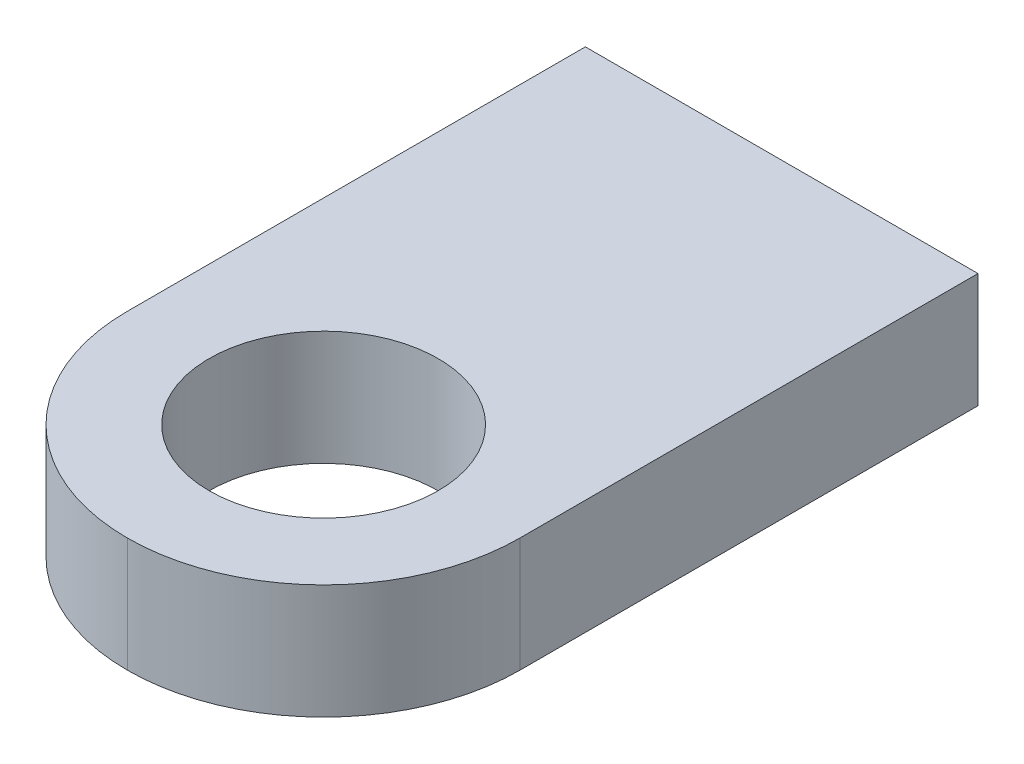
ISO-10303-21;
HEADER;
FILE_DESCRIPTION(('STEP AP214'),'2;1');
FILE_NAME('part.step','',(''),(''),'','','');
FILE_SCHEMA(('AUTOMOTIVE_DESIGN { 1 0 10303 214 1 1 1 1 }'));
ENDSEC;
DATA;
#1=APPLICATION_CONTEXT('core data for automotive mechanical design processes');
#2=APPLICATION_PROTOCOL_DEFINITION('international standard','automotive_design',2000,#1);
#3=PRODUCT_CONTEXT('',#1,'mechanical');
#4=PRODUCT('Part','Part','',(#3));
#5=PRODUCT_RELATED_PRODUCT_CATEGORY('part','',(#4));
#6=PRODUCT_DEFINITION_FORMATION('','',#4);
#7=PRODUCT_DEFINITION_CONTEXT('part definition',#1,'design');
#8=PRODUCT_DEFINITION('design','',#6,#7);
#9=PRODUCT_DEFINITION_SHAPE('','',#8);
#10=(LENGTH_UNIT() NAMED_UNIT(*) SI_UNIT(.MILLI.,.METRE.));
#11=(NAMED_UNIT(*) PLANE_ANGLE_UNIT() SI_UNIT($,.RADIAN.));
#12=(NAMED_UNIT(*) SI_UNIT($,.STERADIAN.) SOLID_ANGLE_UNIT());
#13=UNCERTAINTY_MEASURE_WITH_UNIT(LENGTH_MEASURE(1.E-05),#10,'distance_accuracy_value','');
#14=(GEOMETRIC_REPRESENTATION_CONTEXT(3) GLOBAL_UNCERTAINTY_ASSIGNED_CONTEXT((#13)) GLOBAL_UNIT_ASSIGNED_CONTEXT((#10,
#11,#12)) REPRESENTATION_CONTEXT('',''));
#15=CARTESIAN_POINT('',(0.,0.,0.));
#16=DIRECTION('',(0.,0.,1.));
#17=DIRECTION('',(1.,0.,0.));
#18=AXIS2_PLACEMENT_3D('',#15,#16,#17);
#19=CARTESIAN_POINT('',(15.1,0.,19.));
#20=DIRECTION('',(0.,1.,0.));
#21=DIRECTION('',(-1.,0.,0.));
#22=AXIS2_PLACEMENT_3D('',#19,#20,#21);
#23=CYLINDRICAL_SURFACE('',#22,6.);
#24=DIRECTION('',(0.,-1.,0.));
#25=VECTOR('',#24,1.);
#26=CARTESIAN_POINT('',(9.1,12.,19.));
#27=LINE('',#26,#25);
#28=CARTESIAN_POINT('',(9.1,8.5,19.));
#29=VERTEX_POINT('',#28);
#30=CARTESIAN_POINT('',(9.1,12.,19.));
#31=VERTEX_POINT('',#30);
#32=EDGE_CURVE('E12',#29,#31,#27,.F.);
#33=ORIENTED_EDGE('',*,*,#32,.F.);
#34=CARTESIAN_POINT('',(15.1,8.5,19.));
#35=DIRECTION('',(0.,1.,0.));
#36=DIRECTION('',(0.,0.,1.));
#37=AXIS2_PLACEMENT_3D('',#34,#35,#36);
#38=CIRCLE('',#37,6.);
#39=CARTESIAN_POINT('',(15.1,8.5,25.));
#40=VERTEX_POINT('',#39);
#41=EDGE_CURVE('E51',#40,#29,#38,.F.);
#42=ORIENTED_EDGE('',*,*,#41,.F.);
#43=DIRECTION('',(0.,-1.,0.));
#44=VECTOR('',#43,1.);
#45=CARTESIAN_POINT('',(15.1,8.49999999999999,25.));
#46=LINE('',#45,#44);
#47=CARTESIAN_POINT('',(15.1,12.,25.));
#48=VERTEX_POINT('',#47);
#49=EDGE_CURVE('E39',#48,#40,#46,.T.);
#50=ORIENTED_EDGE('',*,*,#49,.F.);
#51=CARTESIAN_POINT('',(15.1,12.,19.));
#52=DIRECTION('',(0.,-1.,0.));
#53=DIRECTION('',(0.,0.,-1.));
#54=AXIS2_PLACEMENT_3D('',#51,#52,#53);
#55=CIRCLE('',#54,6.);
#56=EDGE_CURVE('E111',#31,#48,#55,.F.);
#57=ORIENTED_EDGE('',*,*,#56,.F.);
#58=EDGE_LOOP('',(#33,#42,#50,#57));
#59=FACE_BOUND('',#58,.T.);
#60=ADVANCED_FACE('F36',(#59),#23,.T.);
#61=CARTESIAN_POINT('',(15.1,-1.39949493661167,19.));
#62=DIRECTION('',(0.,1.,0.));
#63=DIRECTION('',(0.,0.,1.));
#64=AXIS2_PLACEMENT_3D('',#61,#62,#63);
#65=CYLINDRICAL_SURFACE('',#64,3.5);
#66=CARTESIAN_POINT('',(15.1,8.5,19.));
#67=DIRECTION('',(0.,1.,0.));
#68=DIRECTION('',(0.,0.,1.));
#69=AXIS2_PLACEMENT_3D('',#66,#67,#68);
#70=CIRCLE('',#69,3.5);
#71=CARTESIAN_POINT('',(15.1,8.5,22.5));
#72=VERTEX_POINT('',#71);
#73=EDGE_CURVE('E98',#72,#72,#70,.F.);
#74=CARTESIAN_POINT('',(15.1,12.,19.));
#75=DIRECTION('',(0.,1.,0.));
#76=DIRECTION('',(0.,0.,1.));
#77=AXIS2_PLACEMENT_3D('',#74,#75,#76);
#78=CIRCLE('',#77,3.5);
#79=CARTESIAN_POINT('',(15.1,12.,22.5));
#80=VERTEX_POINT('',#79);
#81=EDGE_CURVE('E129',#80,#80,#78,.T.);
#82=CARTESIAN_POINT('',(15.1,8.5,22.5));
#83=CARTESIAN_POINT('',(15.1,8.53645833333333,22.5));
#84=CARTESIAN_POINT('',(15.1,8.57291666666667,22.5));
#85=CARTESIAN_POINT('',(15.1,8.64583333333333,22.5));
#86=CARTESIAN_POINT('',(15.1,8.68229166666667,22.5));
#87=CARTESIAN_POINT('',(15.1,8.75520833333333,22.5));
#88=CARTESIAN_POINT('',(15.1,8.79166666666667,22.5));
#89=CARTESIAN_POINT('',(15.1,8.86458333333333,22.5));
#90=CARTESIAN_POINT('',(15.1,8.90104166666667,22.5));
#91=CARTESIAN_POINT('',(15.1,8.97395833333333,22.5));
#92=CARTESIAN_POINT('',(15.1,9.01041666666667,22.5));
#93=CARTESIAN_POINT('',(15.1,9.08333333333333,22.5));
#94=CARTESIAN_POINT('',(15.1,9.11979166666667,22.5));
#95=CARTESIAN_POINT('',(15.1,9.19270833333333,22.5));
#96=CARTESIAN_POINT('',(15.1,9.22916666666667,22.5));
#97=CARTESIAN_POINT('',(15.1,9.30208333333333,22.5));
#98=CARTESIAN_POINT('',(15.1,9.33854166666667,22.5));
#99=CARTESIAN_POINT('',(15.1,9.41145833333333,22.5));
#100=CARTESIAN_POINT('',(15.1,9.44791666666667,22.5));
#101=CARTESIAN_POINT('',(15.1,9.52083333333333,22.5));
#102=CARTESIAN_POINT('',(15.1,9.55729166666667,22.5));
#103=CARTESIAN_POINT('',(15.1,9.63020833333333,22.5));
#104=CARTESIAN_POINT('',(15.1,9.66666666666667,22.5));
#105=CARTESIAN_POINT('',(15.1,9.73958333333333,22.5));
#106=CARTESIAN_POINT('',(15.1,9.77604166666667,22.5));
#107=CARTESIAN_POINT('',(15.1,9.84895833333333,22.5));
#108=CARTESIAN_POINT('',(15.1,9.88541666666667,22.5));
#109=CARTESIAN_POINT('',(15.1,9.95833333333333,22.5));
#110=CARTESIAN_POINT('',(15.1,9.99479166666667,22.5));
#111=CARTESIAN_POINT('',(15.1,10.0677083333333,22.5));
#112=CARTESIAN_POINT('',(15.1,10.1041666666667,22.5));
#113=CARTESIAN_POINT('',(15.1,10.1770833333333,22.5));
#114=CARTESIAN_POINT('',(15.1,10.2135416666667,22.5));
#115=CARTESIAN_POINT('',(15.1,10.2864583333333,22.5));
#116=CARTESIAN_POINT('',(15.1,10.3229166666667,22.5));
#117=CARTESIAN_POINT('',(15.1,10.3958333333333,22.5));
#118=CARTESIAN_POINT('',(15.1,10.4322916666667,22.5));
#119=CARTESIAN_POINT('',(15.1,10.5052083333333,22.5));
#120=CARTESIAN_POINT('',(15.1,10.5416666666667,22.5));
#121=CARTESIAN_POINT('',(15.1,10.6145833333333,22.5));
#122=CARTESIAN_POINT('',(15.1,10.6510416666667,22.5));
#123=CARTESIAN_POINT('',(15.1,10.7239583333333,22.5));
#124=CARTESIAN_POINT('',(15.1,10.7604166666667,22.5));
#125=CARTESIAN_POINT('',(15.1,10.8333333333333,22.5));
#126=CARTESIAN_POINT('',(15.1,10.8697916666667,22.5));
#127=CARTESIAN_POINT('',(15.1,10.9427083333333,22.5));
#128=CARTESIAN_POINT('',(15.1,10.9791666666667,22.5));
#129=CARTESIAN_POINT('',(15.1,11.0520833333333,22.5));
#130=CARTESIAN_POINT('',(15.1,11.0885416666667,22.5));
#131=CARTESIAN_POINT('',(15.1,11.1614583333333,22.5));
#132=CARTESIAN_POINT('',(15.1,11.1979166666667,22.5));
#133=CARTESIAN_POINT('',(15.1,11.2708333333333,22.5));
#134=CARTESIAN_POINT('',(15.1,11.3072916666667,22.5));
#135=CARTESIAN_POINT('',(15.1,11.3802083333333,22.5));
#136=CARTESIAN_POINT('',(15.1,11.4166666666667,22.5));
#137=CARTESIAN_POINT('',(15.1,11.4895833333333,22.5));
#138=CARTESIAN_POINT('',(15.1,11.5260416666667,22.5));
#139=CARTESIAN_POINT('',(15.1,11.5989583333333,22.5));
#140=CARTESIAN_POINT('',(15.1,11.6354166666667,22.5));
#141=CARTESIAN_POINT('',(15.1,11.7083333333333,22.5));
#142=CARTESIAN_POINT('',(15.1,11.7447916666667,22.5));
#143=CARTESIAN_POINT('',(15.1,11.8177083333333,22.5));
#144=CARTESIAN_POINT('',(15.1,11.8541666666667,22.5));
#145=CARTESIAN_POINT('',(15.1,11.9270833333333,22.5));
#146=CARTESIAN_POINT('',(15.1,11.9635416666667,22.5));
#147=CARTESIAN_POINT('',(15.1,12.,22.5));
#148=B_SPLINE_CURVE_WITH_KNOTS('',3,(#82,#83,#84,#85,#86,#87,#88,#89,#90,#91,#92,#93,#94,#95,
#96,#97,#98,#99,#100,#101,#102,#103,#104,#105,#106,#107,#108,#109,#110,#111,#112,#113,#114,#115,
#116,#117,#118,#119,#120,#121,#122,#123,#124,#125,#126,#127,#128,#129,#130,#131,#132,#133,#134,
#135,#136,#137,#138,#139,#140,#141,#142,#143,#144,#145,#146,#147),.UNSPECIFIED.,.F.,.F.,(4,2,2,
2,2,2,2,2,2,2,2,2,2,2,2,2,2,2,2,2,2,2,2,2,2,2,2,2,2,2,2,2,4),(0.,0.109375,0.21875,0.328125,
0.4375,0.546875,0.656250000000001,0.765625000000001,0.875000000000001,0.984374999999999,1.09375,
1.203125,1.3125,1.421875,1.53125,1.640625,1.75,1.859375,1.96875,2.078125,2.1875,2.296875,
2.40625,2.515625,2.625,2.734375,2.84375,2.953125,3.0625,3.171875,3.28125,3.390625,3.5),.UNSPECIFIED.);
#149=EDGE_CURVE('BSEAM138',#72,#80,#148,.T.);
#150=ORIENTED_EDGE('',*,*,#73,.T.);
#151=ORIENTED_EDGE('',*,*,#81,.T.);
#152=ORIENTED_EDGE('',*,*,#149,.T.);
#153=ORIENTED_EDGE('',*,*,#149,.F.);
#154=EDGE_LOOP('',(#150,#152,#151,#153));
#155=FACE_BOUND('',#154,.T.);
#156=ADVANCED_FACE('F138',(#155),#65,.F.);
#157=CARTESIAN_POINT('',(15.1,0.,19.));
#158=DIRECTION('',(0.,-1.,0.));
#159=DIRECTION('',(0.,0.,-1.));
#160=AXIS2_PLACEMENT_3D('',#157,#158,#159);
#161=CYLINDRICAL_SURFACE('',#160,6.);
#162=CARTESIAN_POINT('',(15.1,8.5,19.));
#163=DIRECTION('',(0.,1.,0.));
#164=DIRECTION('',(0.,0.,1.));
#165=AXIS2_PLACEMENT_3D('',#162,#163,#164);
#166=CIRCLE('',#165,6.);
#167=CARTESIAN_POINT('',(21.1,8.5,19.));
#168=VERTEX_POINT('',#167);
#169=EDGE_CURVE('E44',#168,#40,#166,.F.);
#170=ORIENTED_EDGE('',*,*,#169,.F.);
#171=DIRECTION('',(0.,1.,0.));
#172=VECTOR('',#171,1.);
#173=CARTESIAN_POINT('',(21.1,8.5,19.));
#174=LINE('',#173,#172);
#175=CARTESIAN_POINT('',(21.1,12.,19.));
#176=VERTEX_POINT('',#175);
#177=EDGE_CURVE('E115',#176,#168,#174,.F.);
#178=ORIENTED_EDGE('',*,*,#177,.F.);
#179=CARTESIAN_POINT('',(15.1,12.,19.));
#180=DIRECTION('',(0.,-1.,0.));
#181=DIRECTION('',(0.,0.,-1.));
#182=AXIS2_PLACEMENT_3D('',#179,#180,#181);
#183=CIRCLE('',#182,6.);
#184=EDGE_CURVE('E113',#48,#176,#183,.F.);
#185=ORIENTED_EDGE('',*,*,#184,.F.);
#186=ORIENTED_EDGE('',*,*,#49,.T.);
#187=EDGE_LOOP('',(#170,#178,#185,#186));
#188=FACE_BOUND('',#187,.T.);
#189=ADVANCED_FACE('F135',(#188),#161,.T.);
#190=CARTESIAN_POINT('',(21.1,12.,25.));
#191=DIRECTION('',(-1.,0.,0.));
#192=DIRECTION('',(0.,0.,1.));
#193=AXIS2_PLACEMENT_3D('',#190,#191,#192);
#194=PLANE('',#193);
#195=DIRECTION('',(0.,0.,-1.));
#196=VECTOR('',#195,1.);
#197=CARTESIAN_POINT('',(21.1,12.,25.));
#198=LINE('',#197,#196);
#199=CARTESIAN_POINT('',(21.1,12.,5.));
#200=VERTEX_POINT('',#199);
#201=EDGE_CURVE('E87',#176,#200,#198,.T.);
#202=ORIENTED_EDGE('',*,*,#201,.F.);
#203=ORIENTED_EDGE('',*,*,#177,.T.);
#204=DIRECTION('',(0.,0.,-1.));
#205=VECTOR('',#204,1.);
#206=CARTESIAN_POINT('',(21.1,8.5,25.));
#207=LINE('',#206,#205);
#208=CARTESIAN_POINT('',(21.1,8.5,5.));
#209=VERTEX_POINT('',#208);
#210=EDGE_CURVE('E103',#168,#209,#207,.T.);
#211=ORIENTED_EDGE('',*,*,#210,.T.);
#212=DIRECTION('',(0.,1.,0.));
#213=VECTOR('',#212,1.);
#214=CARTESIAN_POINT('',(21.1,12.,5.));
#215=LINE('',#214,#213);
#216=EDGE_CURVE('E90',#209,#200,#215,.T.);
#217=ORIENTED_EDGE('',*,*,#216,.T.);
#218=EDGE_LOOP('',(#202,#203,#211,#217));
#219=FACE_BOUND('',#218,.T.);
#220=ADVANCED_FACE('F121',(#219),#194,.F.);
#221=CARTESIAN_POINT('',(9.1,8.5,25.));
#222=DIRECTION('',(0.,1.,0.));
#223=DIRECTION('',(0.,0.,1.));
#224=AXIS2_PLACEMENT_3D('',#221,#222,#223);
#225=PLANE('',#224);
#226=ORIENTED_EDGE('',*,*,#73,.F.);
#227=EDGE_LOOP('',(#226));
#228=FACE_BOUND('',#227,.T.);
#229=ORIENTED_EDGE('',*,*,#210,.F.);
#230=ORIENTED_EDGE('',*,*,#169,.T.);
#231=ORIENTED_EDGE('',*,*,#41,.T.);
#232=DIRECTION('',(0.,0.,-1.));
#233=VECTOR('',#232,1.);
#234=CARTESIAN_POINT('',(9.1,8.5,25.));
#235=LINE('',#234,#233);
#236=CARTESIAN_POINT('',(9.1,8.5,5.));
#237=VERTEX_POINT('',#236);
#238=EDGE_CURVE('E109',#29,#237,#235,.T.);
#239=ORIENTED_EDGE('',*,*,#238,.T.);
#240=DIRECTION('',(1.,0.,0.));
#241=VECTOR('',#240,1.);
#242=CARTESIAN_POINT('',(9.1,8.5,5.));
#243=LINE('',#242,#241);
#244=EDGE_CURVE('E96',#237,#209,#243,.T.);
#245=ORIENTED_EDGE('',*,*,#244,.T.);
#246=EDGE_LOOP('',(#229,#230,#231,#239,#245));
#247=FACE_BOUND('',#246,.T.);
#248=ADVANCED_FACE('F124',(#228,#247),#225,.F.);
#249=CARTESIAN_POINT('',(9.1,12.,25.));
#250=DIRECTION('',(1.,0.,0.));
#251=DIRECTION('',(0.,1.,0.));
#252=AXIS2_PLACEMENT_3D('',#249,#250,#251);
#253=PLANE('',#252);
#254=ORIENTED_EDGE('',*,*,#238,.F.);
#255=ORIENTED_EDGE('',*,*,#32,.T.);
#256=DIRECTION('',(0.,0.,-1.));
#257=VECTOR('',#256,1.);
#258=CARTESIAN_POINT('',(9.1,12.,25.));
#259=LINE('',#258,#257);
#260=CARTESIAN_POINT('',(9.1,12.,5.));
#261=VERTEX_POINT('',#260);
#262=EDGE_CURVE('E84',#31,#261,#259,.T.);
#263=ORIENTED_EDGE('',*,*,#262,.T.);
#264=DIRECTION('',(0.,-1.,0.));
#265=VECTOR('',#264,1.);
#266=CARTESIAN_POINT('',(9.1,12.,5.));
#267=LINE('',#266,#265);
#268=EDGE_CURVE('E93',#261,#237,#267,.T.);
#269=ORIENTED_EDGE('',*,*,#268,.T.);
#270=EDGE_LOOP('',(#254,#255,#263,#269));
#271=FACE_BOUND('',#270,.T.);
#272=ADVANCED_FACE('F100',(#271),#253,.F.);
#273=CARTESIAN_POINT('',(0.,12.,5.));
#274=DIRECTION('',(0.,-1.,0.));
#275=DIRECTION('',(0.,0.,-1.));
#276=AXIS2_PLACEMENT_3D('',#273,#274,#275);
#277=PLANE('',#276);
#278=ORIENTED_EDGE('',*,*,#81,.F.);
#279=EDGE_LOOP('',(#278));
#280=FACE_BOUND('',#279,.T.);
#281=ORIENTED_EDGE('',*,*,#201,.T.);
#282=DIRECTION('',(-1.,0.,0.));
#283=VECTOR('',#282,1.);
#284=CARTESIAN_POINT('',(9.1,12.,5.));
#285=LINE('',#284,#283);
#286=EDGE_CURVE('E80',#200,#261,#285,.T.);
#287=ORIENTED_EDGE('',*,*,#286,.T.);
#288=ORIENTED_EDGE('',*,*,#262,.F.);
#289=ORIENTED_EDGE('',*,*,#56,.T.);
#290=ORIENTED_EDGE('',*,*,#184,.T.);
#291=EDGE_LOOP('',(#281,#287,#288,#289,#290));
#292=FACE_BOUND('',#291,.T.);
#293=ADVANCED_FACE('F82',(#280,#292),#277,.F.);
#294=CARTESIAN_POINT('',(0.,0.,5.));
#295=DIRECTION('',(0.,0.,1.));
#296=DIRECTION('',(1.,0.,0.));
#297=AXIS2_PLACEMENT_3D('',#294,#295,#296);
#298=PLANE('',#297);
#299=ORIENTED_EDGE('',*,*,#268,.F.);
#300=ORIENTED_EDGE('',*,*,#286,.F.);
#301=ORIENTED_EDGE('',*,*,#216,.F.);
#302=ORIENTED_EDGE('',*,*,#244,.F.);
#303=EDGE_LOOP('',(#299,#300,#301,#302));
#304=FACE_BOUND('',#303,.T.);
#305=ADVANCED_FACE('F94',(#304),#298,.F.);
#306=CLOSED_SHELL('',(#60,#156,#189,#220,#248,#272,#293,#305));
#307=MANIFOLD_SOLID_BREP('B2',#306);
#308=ADVANCED_BREP_SHAPE_REPRESENTATION('',(#18,#307),#14);
#309=SHAPE_DEFINITION_REPRESENTATION(#9,#308);
ENDSEC;
END-ISO-10303-21;
